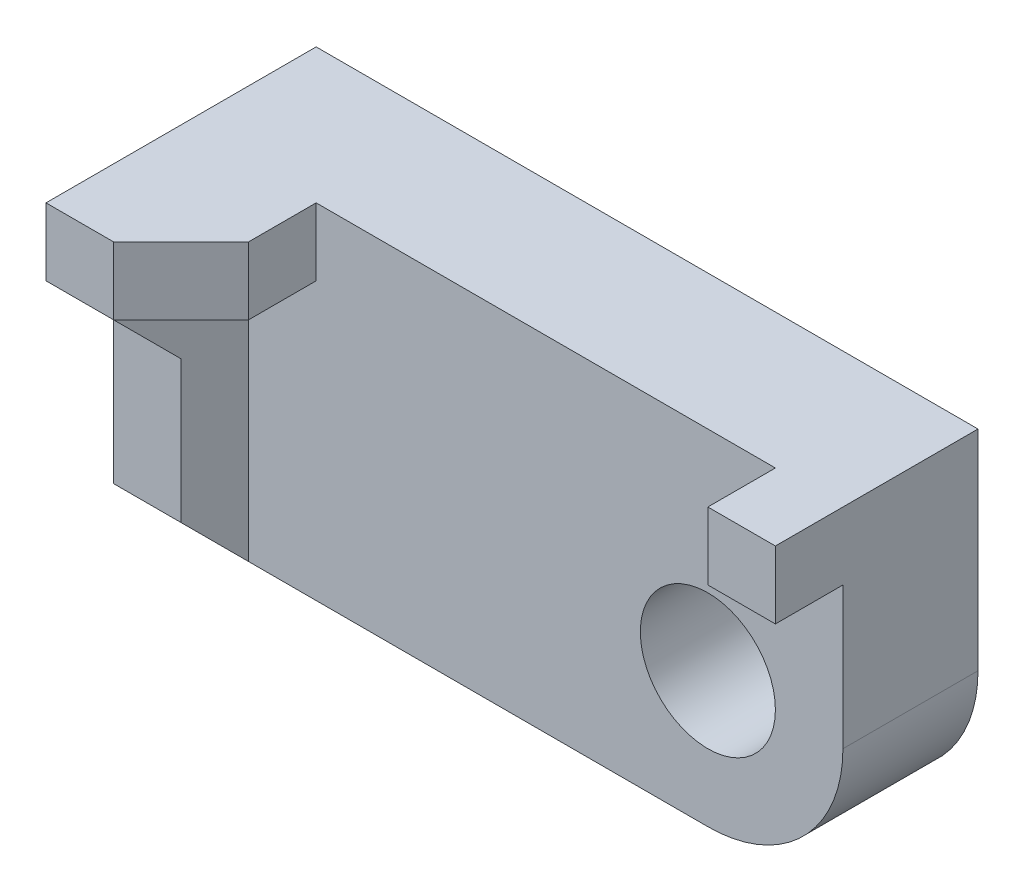
ISO-10303-21;
HEADER;
FILE_DESCRIPTION(('STEP AP214'),'2;1');
FILE_NAME('part.step','',(''),(''),'','','');
FILE_SCHEMA(('AUTOMOTIVE_DESIGN { 1 0 10303 214 1 1 1 1 }'));
ENDSEC;
DATA;
#1=APPLICATION_CONTEXT('core data for automotive mechanical design processes');
#2=APPLICATION_PROTOCOL_DEFINITION('international standard','automotive_design',2000,#1);
#3=PRODUCT_CONTEXT('',#1,'mechanical');
#4=PRODUCT('Part','Part','',(#3));
#5=PRODUCT_RELATED_PRODUCT_CATEGORY('part','',(#4));
#6=PRODUCT_DEFINITION_FORMATION('','',#4);
#7=PRODUCT_DEFINITION_CONTEXT('part definition',#1,'design');
#8=PRODUCT_DEFINITION('design','',#6,#7);
#9=PRODUCT_DEFINITION_SHAPE('','',#8);
#10=(LENGTH_UNIT() NAMED_UNIT(*) SI_UNIT(.MILLI.,.METRE.));
#11=(NAMED_UNIT(*) PLANE_ANGLE_UNIT() SI_UNIT($,.RADIAN.));
#12=(NAMED_UNIT(*) SI_UNIT($,.STERADIAN.) SOLID_ANGLE_UNIT());
#13=UNCERTAINTY_MEASURE_WITH_UNIT(LENGTH_MEASURE(1.E-05),#10,'distance_accuracy_value','');
#14=(GEOMETRIC_REPRESENTATION_CONTEXT(3) GLOBAL_UNCERTAINTY_ASSIGNED_CONTEXT((#13)) GLOBAL_UNIT_ASSIGNED_CONTEXT((#10,
#11,#12)) REPRESENTATION_CONTEXT('',''));
#15=CARTESIAN_POINT('',(0.,0.,0.));
#16=DIRECTION('',(0.,0.,1.));
#17=DIRECTION('',(1.,0.,0.));
#18=AXIS2_PLACEMENT_3D('',#15,#16,#17);
#19=CARTESIAN_POINT('',(0.,-51.,20.));
#20=DIRECTION('',(0.,1.,0.));
#21=DIRECTION('',(0.,0.,1.));
#22=AXIS2_PLACEMENT_3D('',#19,#20,#21);
#23=PLANE('',#22);
#24=DIRECTION('',(-1.,0.,0.));
#25=VECTOR('',#24,1.);
#26=CARTESIAN_POINT('',(169.368350913327,-51.,20.));
#27=LINE('',#26,#25);
#28=CARTESIAN_POINT('',(10.,-51.,20.));
#29=VERTEX_POINT('',#28);
#30=CARTESIAN_POINT('',(0.,-51.,20.));
#31=VERTEX_POINT('',#30);
#32=EDGE_CURVE('E146',#29,#31,#27,.T.);
#33=ORIENTED_EDGE('',*,*,#32,.T.);
#34=DIRECTION('',(0.,0.,-1.));
#35=VECTOR('',#34,1.);
#36=CARTESIAN_POINT('',(0.,-51.,30.));
#37=LINE('',#36,#35);
#38=CARTESIAN_POINT('',(0.,-51.,0.));
#39=VERTEX_POINT('',#38);
#40=EDGE_CURVE('E153',#31,#39,#37,.T.);
#41=ORIENTED_EDGE('',*,*,#40,.T.);
#42=DIRECTION('',(1.,0.,0.));
#43=VECTOR('',#42,1.);
#44=CARTESIAN_POINT('',(0.,-51.,0.));
#45=LINE('',#44,#43);
#46=CARTESIAN_POINT('',(78.,-51.,0.));
#47=VERTEX_POINT('',#46);
#48=EDGE_CURVE('E195',#39,#47,#45,.T.);
#49=ORIENTED_EDGE('',*,*,#48,.T.);
#50=DIRECTION('',(0.,0.,-1.));
#51=VECTOR('',#50,1.);
#52=CARTESIAN_POINT('',(78.,-51.,20.));
#53=LINE('',#52,#51);
#54=CARTESIAN_POINT('',(78.,-51.,20.));
#55=VERTEX_POINT('',#54);
#56=EDGE_CURVE('E202',#55,#47,#53,.T.);
#57=ORIENTED_EDGE('',*,*,#56,.F.);
#58=DIRECTION('',(1.,0.,0.));
#59=VECTOR('',#58,1.);
#60=CARTESIAN_POINT('',(0.,-51.,20.));
#61=LINE('',#60,#59);
#62=EDGE_CURVE('E168',#29,#55,#61,.T.);
#63=ORIENTED_EDGE('',*,*,#62,.F.);
#64=EDGE_LOOP('',(#33,#41,#49,#57,#63));
#65=FACE_BOUND('',#64,.T.);
#66=ADVANCED_FACE('F37',(#65),#23,.F.);
#67=CARTESIAN_POINT('',(10.,0.,30.));
#68=DIRECTION('',(1.,0.,0.));
#69=DIRECTION('',(0.,0.,-1.));
#70=AXIS2_PLACEMENT_3D('',#67,#68,#69);
#71=PLANE('',#70);
#72=DIRECTION('',(0.,-1.,0.));
#73=VECTOR('',#72,1.);
#74=CARTESIAN_POINT('',(10.,0.,30.));
#75=LINE('',#74,#73);
#76=CARTESIAN_POINT('',(10.,-20.,30.));
#77=VERTEX_POINT('',#76);
#78=CARTESIAN_POINT('',(10.,-41.,30.));
#79=VERTEX_POINT('',#78);
#80=EDGE_CURVE('E158',#77,#79,#75,.T.);
#81=ORIENTED_EDGE('',*,*,#80,.T.);
#82=DIRECTION('',(0.,0.707106781186548,0.707106781186548));
#83=VECTOR('',#82,1.);
#84=CARTESIAN_POINT('',(10.,-51.,20.));
#85=LINE('',#84,#83);
#86=EDGE_CURVE('E52',#29,#79,#85,.T.);
#87=ORIENTED_EDGE('',*,*,#86,.F.);
#88=DIRECTION('',(0.,-1.,0.));
#89=VECTOR('',#88,1.);
#90=CARTESIAN_POINT('',(10.,0.,20.));
#91=LINE('',#90,#89);
#92=CARTESIAN_POINT('',(10.,-10.,20.));
#93=VERTEX_POINT('',#92);
#94=EDGE_CURVE('E189',#93,#29,#91,.T.);
#95=ORIENTED_EDGE('',*,*,#94,.F.);
#96=DIRECTION('',(0.,0.,-1.));
#97=VECTOR('',#96,1.);
#98=CARTESIAN_POINT('',(10.,-10.,40.));
#99=LINE('',#98,#97);
#100=CARTESIAN_POINT('',(10.,-10.,40.));
#101=VERTEX_POINT('',#100);
#102=EDGE_CURVE('E250',#101,#93,#99,.T.);
#103=ORIENTED_EDGE('',*,*,#102,.F.);
#104=DIRECTION('',(0.,-0.707106781186548,-0.707106781186547));
#105=VECTOR('',#104,1.);
#106=CARTESIAN_POINT('',(10.,-10.,40.));
#107=LINE('',#106,#105);
#108=EDGE_CURVE('E264',#101,#77,#107,.T.);
#109=ORIENTED_EDGE('',*,*,#108,.T.);
#110=EDGE_LOOP('',(#81,#87,#95,#103,#109));
#111=FACE_BOUND('',#110,.T.);
#112=ADVANCED_FACE('F287',(#111),#71,.T.);
#113=CARTESIAN_POINT('',(0.,0.,30.));
#114=DIRECTION('',(0.,0.,1.));
#115=DIRECTION('',(1.,0.,0.));
#116=AXIS2_PLACEMENT_3D('',#113,#114,#115);
#117=PLANE('',#116);
#118=DIRECTION('',(0.,-1.,0.));
#119=VECTOR('',#118,1.);
#120=CARTESIAN_POINT('',(0.,0.,30.));
#121=LINE('',#120,#119);
#122=CARTESIAN_POINT('',(0.,-20.,30.));
#123=VERTEX_POINT('',#122);
#124=CARTESIAN_POINT('',(0.,-41.,30.));
#125=VERTEX_POINT('',#124);
#126=EDGE_CURVE('E150',#123,#125,#121,.T.);
#127=ORIENTED_EDGE('',*,*,#126,.T.);
#128=DIRECTION('',(-1.,0.,0.));
#129=VECTOR('',#128,1.);
#130=CARTESIAN_POINT('',(169.368350913327,-41.,30.));
#131=LINE('',#130,#129);
#132=EDGE_CURVE('E138',#79,#125,#131,.T.);
#133=ORIENTED_EDGE('',*,*,#132,.F.);
#134=ORIENTED_EDGE('',*,*,#80,.F.);
#135=DIRECTION('',(1.,0.,0.));
#136=VECTOR('',#135,1.);
#137=CARTESIAN_POINT('',(0.,-20.,30.));
#138=LINE('',#137,#136);
#139=EDGE_CURVE('E157',#123,#77,#138,.T.);
#140=ORIENTED_EDGE('',*,*,#139,.F.);
#141=EDGE_LOOP('',(#127,#133,#134,#140));
#142=FACE_BOUND('',#141,.T.);
#143=ADVANCED_FACE('F155',(#142),#117,.T.);
#144=CARTESIAN_POINT('',(0.,0.,40.));
#145=DIRECTION('',(1.,0.,0.));
#146=DIRECTION('',(0.,1.,0.));
#147=AXIS2_PLACEMENT_3D('',#144,#145,#146);
#148=PLANE('',#147);
#149=ORIENTED_EDGE('',*,*,#40,.F.);
#150=DIRECTION('',(0.,0.707106781186548,0.707106781186548));
#151=VECTOR('',#150,1.);
#152=CARTESIAN_POINT('',(0.,-51.,20.));
#153=LINE('',#152,#151);
#154=EDGE_CURVE('E141',#31,#125,#153,.T.);
#155=ORIENTED_EDGE('',*,*,#154,.T.);
#156=ORIENTED_EDGE('',*,*,#126,.F.);
#157=DIRECTION('',(0.,-0.707106781186548,-0.707106781186547));
#158=VECTOR('',#157,1.);
#159=CARTESIAN_POINT('',(0.,-10.,40.));
#160=LINE('',#159,#158);
#161=CARTESIAN_POINT('',(0.,-10.,40.));
#162=VERTEX_POINT('',#161);
#163=EDGE_CURVE('E60',#162,#123,#160,.T.);
#164=ORIENTED_EDGE('',*,*,#163,.F.);
#165=DIRECTION('',(0.,-1.,0.));
#166=VECTOR('',#165,1.);
#167=CARTESIAN_POINT('',(0.,0.,40.));
#168=LINE('',#167,#166);
#169=CARTESIAN_POINT('',(0.,0.,40.));
#170=VERTEX_POINT('',#169);
#171=EDGE_CURVE('E45',#170,#162,#168,.T.);
#172=ORIENTED_EDGE('',*,*,#171,.F.);
#173=DIRECTION('',(0.,0.,-1.));
#174=VECTOR('',#173,1.);
#175=CARTESIAN_POINT('',(0.,0.,40.));
#176=LINE('',#175,#174);
#177=CARTESIAN_POINT('',(0.,0.,0.));
#178=VERTEX_POINT('',#177);
#179=EDGE_CURVE('E11',#170,#178,#176,.T.);
#180=ORIENTED_EDGE('',*,*,#179,.T.);
#181=DIRECTION('',(0.,-1.,0.));
#182=VECTOR('',#181,1.);
#183=CARTESIAN_POINT('',(0.,0.,0.));
#184=LINE('',#183,#182);
#185=EDGE_CURVE('E239',#178,#39,#184,.T.);
#186=ORIENTED_EDGE('',*,*,#185,.T.);
#187=EDGE_LOOP('',(#149,#155,#156,#164,#172,#180,#186));
#188=FACE_BOUND('',#187,.T.);
#189=ADVANCED_FACE('F149',(#188),#148,.F.);
#190=CARTESIAN_POINT('',(0.,-10.,40.));
#191=DIRECTION('',(0.,-1.,0.));
#192=DIRECTION('',(0.,0.,-1.));
#193=AXIS2_PLACEMENT_3D('',#190,#191,#192);
#194=PLANE('',#193);
#195=DIRECTION('',(0.,0.,-1.));
#196=VECTOR('',#195,1.);
#197=CARTESIAN_POINT('',(20.,-10.,40.));
#198=LINE('',#197,#196);
#199=CARTESIAN_POINT('',(20.,-10.,30.));
#200=VERTEX_POINT('',#199);
#201=CARTESIAN_POINT('',(20.,-10.,20.));
#202=VERTEX_POINT('',#201);
#203=EDGE_CURVE('E233',#200,#202,#198,.T.);
#204=ORIENTED_EDGE('',*,*,#203,.F.);
#205=DIRECTION('',(0.707106781186547,0.,-0.707106781186548));
#206=VECTOR('',#205,1.);
#207=CARTESIAN_POINT('',(10.,-10.,40.));
#208=LINE('',#207,#206);
#209=EDGE_CURVE('E251',#101,#200,#208,.T.);
#210=ORIENTED_EDGE('',*,*,#209,.F.);
#211=ORIENTED_EDGE('',*,*,#102,.T.);
#212=DIRECTION('',(1.,0.,0.));
#213=VECTOR('',#212,1.);
#214=CARTESIAN_POINT('',(0.,-9.99999999999999,20.));
#215=LINE('',#214,#213);
#216=EDGE_CURVE('E186',#93,#202,#215,.T.);
#217=ORIENTED_EDGE('',*,*,#216,.T.);
#218=EDGE_LOOP('',(#204,#210,#211,#217));
#219=FACE_BOUND('',#218,.T.);
#220=ADVANCED_FACE('F39',(#219),#194,.T.);
#221=CARTESIAN_POINT('',(0.,0.,40.));
#222=DIRECTION('',(0.,1.,0.));
#223=DIRECTION('',(0.,0.,1.));
#224=AXIS2_PLACEMENT_3D('',#221,#222,#223);
#225=PLANE('',#224);
#226=DIRECTION('',(1.,0.,0.));
#227=VECTOR('',#226,1.);
#228=CARTESIAN_POINT('',(0.,0.,40.));
#229=LINE('',#228,#227);
#230=CARTESIAN_POINT('',(10.,0.,40.));
#231=VERTEX_POINT('',#230);
#232=EDGE_CURVE('E236',#170,#231,#229,.T.);
#233=ORIENTED_EDGE('',*,*,#232,.T.);
#234=DIRECTION('',(0.707106781186547,0.,-0.707106781186548));
#235=VECTOR('',#234,1.);
#236=CARTESIAN_POINT('',(10.,0.,40.));
#237=LINE('',#236,#235);
#238=CARTESIAN_POINT('',(20.,0.,30.));
#239=VERTEX_POINT('',#238);
#240=EDGE_CURVE('E261',#231,#239,#237,.T.);
#241=ORIENTED_EDGE('',*,*,#240,.T.);
#242=DIRECTION('',(0.,0.,-1.));
#243=VECTOR('',#242,1.);
#244=CARTESIAN_POINT('',(20.,0.,40.));
#245=LINE('',#244,#243);
#246=CARTESIAN_POINT('',(20.,0.,20.));
#247=VERTEX_POINT('',#246);
#248=EDGE_CURVE('E231',#239,#247,#245,.T.);
#249=ORIENTED_EDGE('',*,*,#248,.T.);
#250=DIRECTION('',(1.,0.,0.));
#251=VECTOR('',#250,1.);
#252=CARTESIAN_POINT('',(0.,0.,20.));
#253=LINE('',#252,#251);
#254=CARTESIAN_POINT('',(88.,0.,20.));
#255=VERTEX_POINT('',#254);
#256=EDGE_CURVE('E180',#247,#255,#253,.T.);
#257=ORIENTED_EDGE('',*,*,#256,.T.);
#258=DIRECTION('',(0.,0.,-1.));
#259=VECTOR('',#258,1.);
#260=CARTESIAN_POINT('',(88.,0.,30.));
#261=LINE('',#260,#259);
#262=CARTESIAN_POINT('',(88.,0.,30.));
#263=VERTEX_POINT('',#262);
#264=EDGE_CURVE('E217',#263,#255,#261,.T.);
#265=ORIENTED_EDGE('',*,*,#264,.F.);
#266=DIRECTION('',(1.,0.,0.));
#267=VECTOR('',#266,1.);
#268=CARTESIAN_POINT('',(0.,0.,30.));
#269=LINE('',#268,#267);
#270=CARTESIAN_POINT('',(98.,0.,30.));
#271=VERTEX_POINT('',#270);
#272=EDGE_CURVE('E214',#263,#271,#269,.T.);
#273=ORIENTED_EDGE('',*,*,#272,.T.);
#274=DIRECTION('',(0.,0.,-1.));
#275=VECTOR('',#274,1.);
#276=CARTESIAN_POINT('',(98.,0.,30.));
#277=LINE('',#276,#275);
#278=CARTESIAN_POINT('',(98.,0.,0.));
#279=VERTEX_POINT('',#278);
#280=EDGE_CURVE('E222',#271,#279,#277,.T.);
#281=ORIENTED_EDGE('',*,*,#280,.T.);
#282=DIRECTION('',(1.,0.,0.));
#283=VECTOR('',#282,1.);
#284=CARTESIAN_POINT('',(0.,0.,0.));
#285=LINE('',#284,#283);
#286=EDGE_CURVE('E235',#178,#279,#285,.T.);
#287=ORIENTED_EDGE('',*,*,#286,.F.);
#288=ORIENTED_EDGE('',*,*,#179,.F.);
#289=EDGE_LOOP('',(#233,#241,#249,#257,#265,#273,#281,#287,#288));
#290=FACE_BOUND('',#289,.T.);
#291=ADVANCED_FACE('F291',(#290),#225,.T.);
#292=CARTESIAN_POINT('',(0.,0.,40.));
#293=DIRECTION('',(0.,0.,1.));
#294=DIRECTION('',(1.,0.,0.));
#295=AXIS2_PLACEMENT_3D('',#292,#293,#294);
#296=PLANE('',#295);
#297=DIRECTION('',(-1.,0.,0.));
#298=VECTOR('',#297,1.);
#299=CARTESIAN_POINT('',(169.368350913326,-10.,40.));
#300=LINE('',#299,#298);
#301=EDGE_CURVE('E267',#101,#162,#300,.T.);
#302=ORIENTED_EDGE('',*,*,#301,.F.);
#303=DIRECTION('',(0.,1.,0.));
#304=VECTOR('',#303,1.);
#305=CARTESIAN_POINT('',(10.,-156.868350913326,40.));
#306=LINE('',#305,#304);
#307=EDGE_CURVE('E256',#101,#231,#306,.T.);
#308=ORIENTED_EDGE('',*,*,#307,.T.);
#309=ORIENTED_EDGE('',*,*,#232,.F.);
#310=ORIENTED_EDGE('',*,*,#171,.T.);
#311=EDGE_LOOP('',(#302,#308,#309,#310));
#312=FACE_BOUND('',#311,.T.);
#313=ADVANCED_FACE('F277',(#312),#296,.T.);
#314=CARTESIAN_POINT('',(20.,0.,40.));
#315=DIRECTION('',(-1.,0.,0.));
#316=DIRECTION('',(0.,0.,1.));
#317=AXIS2_PLACEMENT_3D('',#314,#315,#316);
#318=PLANE('',#317);
#319=DIRECTION('',(0.,1.,0.));
#320=VECTOR('',#319,1.);
#321=CARTESIAN_POINT('',(20.,-156.868350913326,30.));
#322=LINE('',#321,#320);
#323=EDGE_CURVE('E258',#200,#239,#322,.T.);
#324=ORIENTED_EDGE('',*,*,#323,.F.);
#325=ORIENTED_EDGE('',*,*,#203,.T.);
#326=DIRECTION('',(0.,1.,0.));
#327=VECTOR('',#326,1.);
#328=CARTESIAN_POINT('',(20.,0.,20.));
#329=LINE('',#328,#327);
#330=EDGE_CURVE('E183',#202,#247,#329,.T.);
#331=ORIENTED_EDGE('',*,*,#330,.T.);
#332=ORIENTED_EDGE('',*,*,#248,.F.);
#333=EDGE_LOOP('',(#324,#325,#331,#332));
#334=FACE_BOUND('',#333,.T.);
#335=ADVANCED_FACE('F316',(#334),#318,.F.);
#336=CARTESIAN_POINT('',(0.,0.,0.));
#337=DIRECTION('',(0.,0.,1.));
#338=DIRECTION('',(1.,0.,0.));
#339=AXIS2_PLACEMENT_3D('',#336,#337,#338);
#340=PLANE('',#339);
#341=ORIENTED_EDGE('',*,*,#48,.F.);
#342=ORIENTED_EDGE('',*,*,#185,.F.);
#343=ORIENTED_EDGE('',*,*,#286,.T.);
#344=DIRECTION('',(0.,1.,0.));
#345=VECTOR('',#344,1.);
#346=CARTESIAN_POINT('',(98.,0.,0.));
#347=LINE('',#346,#345);
#348=CARTESIAN_POINT('',(98.,-31.,0.));
#349=VERTEX_POINT('',#348);
#350=EDGE_CURVE('E205',#349,#279,#347,.T.);
#351=ORIENTED_EDGE('',*,*,#350,.F.);
#352=CARTESIAN_POINT('',(78.,-31.,0.));
#353=DIRECTION('',(0.,0.,1.));
#354=DIRECTION('',(1.,0.,0.));
#355=AXIS2_PLACEMENT_3D('',#352,#353,#354);
#356=CIRCLE('',#355,20.);
#357=EDGE_CURVE('E169',#47,#349,#356,.T.);
#358=ORIENTED_EDGE('',*,*,#357,.F.);
#359=EDGE_LOOP('',(#341,#342,#343,#351,#358));
#360=FACE_BOUND('',#359,.T.);
#361=CARTESIAN_POINT('',(78.,-31.,0.));
#362=DIRECTION('',(0.,0.,1.));
#363=DIRECTION('',(1.,0.,0.));
#364=AXIS2_PLACEMENT_3D('',#361,#362,#363);
#365=CIRCLE('',#364,9.99999999999999);
#366=CARTESIAN_POINT('',(88.,-31.,0.));
#367=VERTEX_POINT('',#366);
#368=EDGE_CURVE('E160',#367,#367,#365,.T.);
#369=ORIENTED_EDGE('',*,*,#368,.T.);
#370=EDGE_LOOP('',(#369));
#371=FACE_BOUND('',#370,.T.);
#372=ADVANCED_FACE('F245',(#360,#371),#340,.F.);
#373=CARTESIAN_POINT('',(88.,0.,30.));
#374=DIRECTION('',(-1.,0.,0.));
#375=DIRECTION('',(0.,0.,1.));
#376=AXIS2_PLACEMENT_3D('',#373,#374,#375);
#377=PLANE('',#376);
#378=DIRECTION('',(0.,1.,0.));
#379=VECTOR('',#378,1.);
#380=CARTESIAN_POINT('',(88.,0.,20.));
#381=LINE('',#380,#379);
#382=CARTESIAN_POINT('',(88.,-10.,20.));
#383=VERTEX_POINT('',#382);
#384=EDGE_CURVE('E178',#383,#255,#381,.T.);
#385=ORIENTED_EDGE('',*,*,#384,.F.);
#386=DIRECTION('',(0.,0.,-1.));
#387=VECTOR('',#386,1.);
#388=CARTESIAN_POINT('',(88.,-10.,30.));
#389=LINE('',#388,#387);
#390=CARTESIAN_POINT('',(88.,-10.,30.));
#391=VERTEX_POINT('',#390);
#392=EDGE_CURVE('E228',#391,#383,#389,.T.);
#393=ORIENTED_EDGE('',*,*,#392,.F.);
#394=DIRECTION('',(0.,1.,0.));
#395=VECTOR('',#394,1.);
#396=CARTESIAN_POINT('',(88.,0.,30.));
#397=LINE('',#396,#395);
#398=EDGE_CURVE('E206',#391,#263,#397,.T.);
#399=ORIENTED_EDGE('',*,*,#398,.T.);
#400=ORIENTED_EDGE('',*,*,#264,.T.);
#401=EDGE_LOOP('',(#385,#393,#399,#400));
#402=FACE_BOUND('',#401,.T.);
#403=ADVANCED_FACE('F310',(#402),#377,.T.);
#404=CARTESIAN_POINT('',(0.,-10.,30.));
#405=DIRECTION('',(0.,-1.,0.));
#406=DIRECTION('',(1.,0.,0.));
#407=AXIS2_PLACEMENT_3D('',#404,#405,#406);
#408=PLANE('',#407);
#409=DIRECTION('',(-1.,0.,0.));
#410=VECTOR('',#409,1.);
#411=CARTESIAN_POINT('',(0.,-10.,20.));
#412=LINE('',#411,#410);
#413=CARTESIAN_POINT('',(98.,-10.,20.));
#414=VERTEX_POINT('',#413);
#415=EDGE_CURVE('E176',#414,#383,#412,.T.);
#416=ORIENTED_EDGE('',*,*,#415,.F.);
#417=DIRECTION('',(0.,0.,-1.));
#418=VECTOR('',#417,1.);
#419=CARTESIAN_POINT('',(98.,-10.,30.));
#420=LINE('',#419,#418);
#421=CARTESIAN_POINT('',(98.,-10.,30.));
#422=VERTEX_POINT('',#421);
#423=EDGE_CURVE('E225',#422,#414,#420,.T.);
#424=ORIENTED_EDGE('',*,*,#423,.F.);
#425=DIRECTION('',(-1.,0.,0.));
#426=VECTOR('',#425,1.);
#427=CARTESIAN_POINT('',(0.,-10.,30.));
#428=LINE('',#427,#426);
#429=EDGE_CURVE('E209',#422,#391,#428,.T.);
#430=ORIENTED_EDGE('',*,*,#429,.T.);
#431=ORIENTED_EDGE('',*,*,#392,.T.);
#432=EDGE_LOOP('',(#416,#424,#430,#431));
#433=FACE_BOUND('',#432,.T.);
#434=ADVANCED_FACE('F306',(#433),#408,.T.);
#435=CARTESIAN_POINT('',(98.,0.,30.));
#436=DIRECTION('',(-1.,0.,0.));
#437=DIRECTION('',(0.,0.,1.));
#438=AXIS2_PLACEMENT_3D('',#435,#436,#437);
#439=PLANE('',#438);
#440=ORIENTED_EDGE('',*,*,#350,.T.);
#441=ORIENTED_EDGE('',*,*,#280,.F.);
#442=DIRECTION('',(0.,1.,0.));
#443=VECTOR('',#442,1.);
#444=CARTESIAN_POINT('',(98.,0.,30.));
#445=LINE('',#444,#443);
#446=EDGE_CURVE('E212',#422,#271,#445,.T.);
#447=ORIENTED_EDGE('',*,*,#446,.F.);
#448=ORIENTED_EDGE('',*,*,#423,.T.);
#449=DIRECTION('',(0.,1.,0.));
#450=VECTOR('',#449,1.);
#451=CARTESIAN_POINT('',(98.,0.,20.));
#452=LINE('',#451,#450);
#453=CARTESIAN_POINT('',(98.,-31.,20.));
#454=VERTEX_POINT('',#453);
#455=EDGE_CURVE('E174',#454,#414,#452,.T.);
#456=ORIENTED_EDGE('',*,*,#455,.F.);
#457=DIRECTION('',(0.,0.,-1.));
#458=VECTOR('',#457,1.);
#459=CARTESIAN_POINT('',(98.,-31.,20.));
#460=LINE('',#459,#458);
#461=EDGE_CURVE('E192',#454,#349,#460,.T.);
#462=ORIENTED_EDGE('',*,*,#461,.T.);
#463=EDGE_LOOP('',(#440,#441,#447,#448,#456,#462));
#464=FACE_BOUND('',#463,.T.);
#465=ADVANCED_FACE('F299',(#464),#439,.F.);
#466=CARTESIAN_POINT('',(0.,0.,30.));
#467=DIRECTION('',(0.,0.,1.));
#468=DIRECTION('',(1.,0.,0.));
#469=AXIS2_PLACEMENT_3D('',#466,#467,#468);
#470=PLANE('',#469);
#471=ORIENTED_EDGE('',*,*,#398,.F.);
#472=ORIENTED_EDGE('',*,*,#429,.F.);
#473=ORIENTED_EDGE('',*,*,#446,.T.);
#474=ORIENTED_EDGE('',*,*,#272,.F.);
#475=EDGE_LOOP('',(#471,#472,#473,#474));
#476=FACE_BOUND('',#475,.T.);
#477=ADVANCED_FACE('F313',(#476),#470,.T.);
#478=CARTESIAN_POINT('',(78.,-31.,20.));
#479=DIRECTION('',(0.,0.,-1.));
#480=DIRECTION('',(-1.,0.,0.));
#481=AXIS2_PLACEMENT_3D('',#478,#479,#480);
#482=CYLINDRICAL_SURFACE('',#481,20.);
#483=ORIENTED_EDGE('',*,*,#357,.T.);
#484=ORIENTED_EDGE('',*,*,#461,.F.);
#485=CARTESIAN_POINT('',(78.,-31.,20.));
#486=DIRECTION('',(0.,0.,1.));
#487=DIRECTION('',(1.,0.,0.));
#488=AXIS2_PLACEMENT_3D('',#485,#486,#487);
#489=CIRCLE('',#488,20.);
#490=EDGE_CURVE('E172',#55,#454,#489,.T.);
#491=ORIENTED_EDGE('',*,*,#490,.F.);
#492=ORIENTED_EDGE('',*,*,#56,.T.);
#493=EDGE_LOOP('',(#483,#484,#491,#492));
#494=FACE_BOUND('',#493,.T.);
#495=ADVANCED_FACE('F297',(#494),#482,.T.);
#496=CARTESIAN_POINT('',(78.,-31.,20.));
#497=DIRECTION('',(0.,0.,-1.));
#498=DIRECTION('',(-1.,0.,0.));
#499=AXIS2_PLACEMENT_3D('',#496,#497,#498);
#500=CYLINDRICAL_SURFACE('',#499,9.99999999999999);
#501=CARTESIAN_POINT('',(78.,-31.,20.));
#502=DIRECTION('',(0.,0.,1.));
#503=DIRECTION('',(1.,0.,0.));
#504=AXIS2_PLACEMENT_3D('',#501,#502,#503);
#505=CIRCLE('',#504,9.99999999999999);
#506=CARTESIAN_POINT('',(88.,-31.,20.));
#507=VERTEX_POINT('',#506);
#508=EDGE_CURVE('E165',#507,#507,#505,.T.);
#509=ORIENTED_EDGE('',*,*,#508,.T.);
#510=EDGE_LOOP('',(#509));
#511=FACE_BOUND('',#510,.T.);
#512=ORIENTED_EDGE('',*,*,#368,.F.);
#513=EDGE_LOOP('',(#512));
#514=FACE_BOUND('',#513,.T.);
#515=ADVANCED_FACE('F335',(#511,#514),#500,.F.);
#516=CARTESIAN_POINT('',(0.,0.,20.));
#517=DIRECTION('',(0.,0.,1.));
#518=DIRECTION('',(1.,0.,0.));
#519=AXIS2_PLACEMENT_3D('',#516,#517,#518);
#520=PLANE('',#519);
#521=ORIENTED_EDGE('',*,*,#508,.F.);
#522=EDGE_LOOP('',(#521));
#523=FACE_BOUND('',#522,.T.);
#524=ORIENTED_EDGE('',*,*,#62,.T.);
#525=ORIENTED_EDGE('',*,*,#490,.T.);
#526=ORIENTED_EDGE('',*,*,#455,.T.);
#527=ORIENTED_EDGE('',*,*,#415,.T.);
#528=ORIENTED_EDGE('',*,*,#384,.T.);
#529=ORIENTED_EDGE('',*,*,#256,.F.);
#530=ORIENTED_EDGE('',*,*,#330,.F.);
#531=ORIENTED_EDGE('',*,*,#216,.F.);
#532=ORIENTED_EDGE('',*,*,#94,.T.);
#533=EDGE_LOOP('',(#524,#525,#526,#527,#528,#529,#530,#531,#532));
#534=FACE_BOUND('',#533,.T.);
#535=ADVANCED_FACE('F303',(#523,#534),#520,.T.);
#536=CARTESIAN_POINT('',(10.,-156.868350913326,40.));
#537=DIRECTION('',(0.707106781186548,0.,0.707106781186547));
#538=DIRECTION('',(0.707106781186547,0.,-0.707106781186548));
#539=AXIS2_PLACEMENT_3D('',#536,#537,#538);
#540=PLANE('',#539);
#541=ORIENTED_EDGE('',*,*,#307,.F.);
#542=ORIENTED_EDGE('',*,*,#209,.T.);
#543=ORIENTED_EDGE('',*,*,#323,.T.);
#544=ORIENTED_EDGE('',*,*,#240,.F.);
#545=EDGE_LOOP('',(#541,#542,#543,#544));
#546=FACE_BOUND('',#545,.T.);
#547=ADVANCED_FACE('F289',(#546),#540,.T.);
#548=CARTESIAN_POINT('',(169.368350913326,-10.,40.));
#549=DIRECTION('',(0.,0.707106781186547,-0.707106781186548));
#550=DIRECTION('',(0.,0.707106781186548,0.707106781186547));
#551=AXIS2_PLACEMENT_3D('',#548,#549,#550);
#552=PLANE('',#551);
#553=ORIENTED_EDGE('',*,*,#301,.T.);
#554=ORIENTED_EDGE('',*,*,#163,.T.);
#555=ORIENTED_EDGE('',*,*,#139,.T.);
#556=ORIENTED_EDGE('',*,*,#108,.F.);
#557=EDGE_LOOP('',(#553,#554,#555,#556));
#558=FACE_BOUND('',#557,.T.);
#559=ADVANCED_FACE('F273',(#558),#552,.F.);
#560=CARTESIAN_POINT('',(169.368350913327,-51.,20.));
#561=DIRECTION('',(0.,-0.707106781186548,0.707106781186548));
#562=DIRECTION('',(0.,-0.707106781186548,-0.707106781186548));
#563=AXIS2_PLACEMENT_3D('',#560,#561,#562);
#564=PLANE('',#563);
#565=ORIENTED_EDGE('',*,*,#32,.F.);
#566=ORIENTED_EDGE('',*,*,#86,.T.);
#567=ORIENTED_EDGE('',*,*,#132,.T.);
#568=ORIENTED_EDGE('',*,*,#154,.F.);
#569=EDGE_LOOP('',(#565,#566,#567,#568));
#570=FACE_BOUND('',#569,.T.);
#571=ADVANCED_FACE('F140',(#570),#564,.T.);
#572=CLOSED_SHELL('',(#66,#112,#143,#189,#220,#291,#313,#335,#372,#403,#434,#465,#477,#495,#515,
#535,#547,#559,#571));
#573=MANIFOLD_SOLID_BREP('B2',#572);
#574=ADVANCED_BREP_SHAPE_REPRESENTATION('',(#18,#573),#14);
#575=SHAPE_DEFINITION_REPRESENTATION(#9,#574);
ENDSEC;
END-ISO-10303-21;
